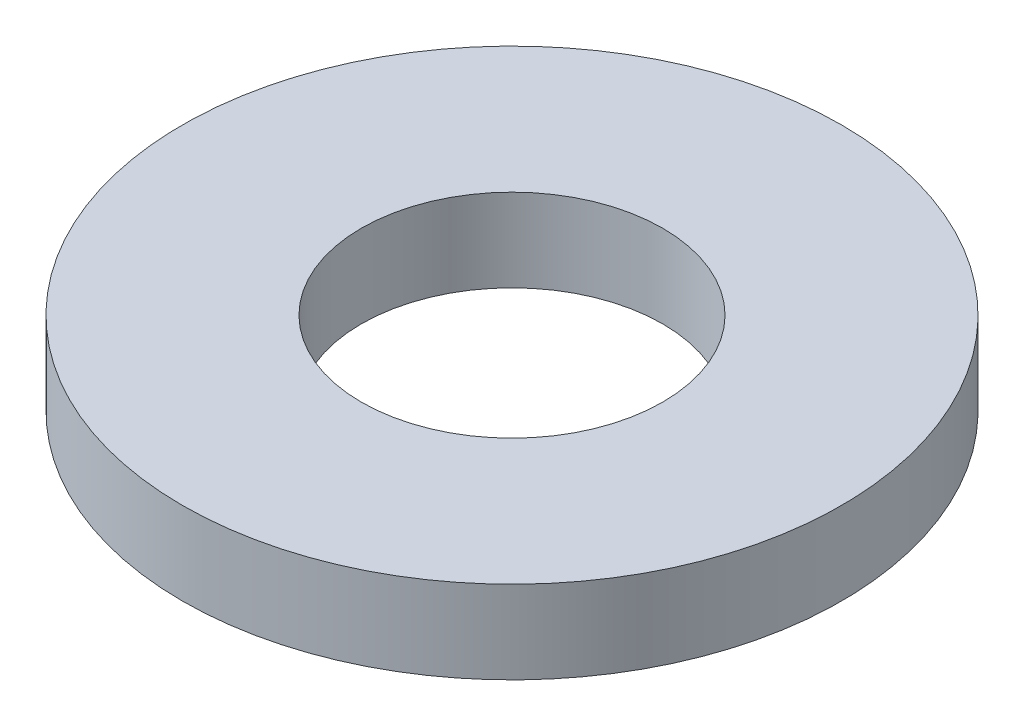
ISO-10303-21;
HEADER;
FILE_DESCRIPTION(('STEP AP214'),'2;1');
FILE_NAME('part.step','',(''),(''),'','','');
FILE_SCHEMA(('AUTOMOTIVE_DESIGN { 1 0 10303 214 1 1 1 1 }'));
ENDSEC;
DATA;
#1=APPLICATION_CONTEXT('core data for automotive mechanical design processes');
#2=APPLICATION_PROTOCOL_DEFINITION('international standard','automotive_design',2000,#1);
#3=PRODUCT_CONTEXT('',#1,'mechanical');
#4=PRODUCT('Part','Part','',(#3));
#5=PRODUCT_RELATED_PRODUCT_CATEGORY('part','',(#4));
#6=PRODUCT_DEFINITION_FORMATION('','',#4);
#7=PRODUCT_DEFINITION_CONTEXT('part definition',#1,'design');
#8=PRODUCT_DEFINITION('design','',#6,#7);
#9=PRODUCT_DEFINITION_SHAPE('','',#8);
#10=(LENGTH_UNIT() NAMED_UNIT(*) SI_UNIT(.MILLI.,.METRE.));
#11=(NAMED_UNIT(*) PLANE_ANGLE_UNIT() SI_UNIT($,.RADIAN.));
#12=(NAMED_UNIT(*) SI_UNIT($,.STERADIAN.) SOLID_ANGLE_UNIT());
#13=UNCERTAINTY_MEASURE_WITH_UNIT(LENGTH_MEASURE(1.E-05),#10,'distance_accuracy_value','');
#14=(GEOMETRIC_REPRESENTATION_CONTEXT(3) GLOBAL_UNCERTAINTY_ASSIGNED_CONTEXT((#13)) GLOBAL_UNIT_ASSIGNED_CONTEXT((#10,
#11,#12)) REPRESENTATION_CONTEXT('',''));
#15=CARTESIAN_POINT('',(0.,0.,0.));
#16=DIRECTION('',(0.,0.,1.));
#17=DIRECTION('',(1.,0.,0.));
#18=AXIS2_PLACEMENT_3D('',#15,#16,#17);
#19=CARTESIAN_POINT('',(0.,22.,0.));
#20=DIRECTION('',(0.,-1.,0.));
#21=DIRECTION('',(0.,0.,-1.));
#22=AXIS2_PLACEMENT_3D('',#19,#20,#21);
#23=CYLINDRICAL_SURFACE('',#22,87.5);
#24=CARTESIAN_POINT('',(0.,22.,0.));
#25=DIRECTION('',(0.,1.,0.));
#26=DIRECTION('',(0.,0.,1.));
#27=AXIS2_PLACEMENT_3D('',#24,#25,#26);
#28=CIRCLE('',#27,87.5);
#29=CARTESIAN_POINT('',(0.,22.,87.5));
#30=VERTEX_POINT('',#29);
#31=EDGE_CURVE('E10',#30,#30,#28,.T.);
#32=ORIENTED_EDGE('',*,*,#31,.F.);
#33=EDGE_LOOP('',(#32));
#34=FACE_BOUND('',#33,.T.);
#35=CARTESIAN_POINT('',(0.,0.,0.));
#36=DIRECTION('',(0.,1.,0.));
#37=DIRECTION('',(0.,0.,1.));
#38=AXIS2_PLACEMENT_3D('',#35,#36,#37);
#39=CIRCLE('',#38,87.5);
#40=CARTESIAN_POINT('',(0.,0.,87.5));
#41=VERTEX_POINT('',#40);
#42=EDGE_CURVE('E37',#41,#41,#39,.T.);
#43=ORIENTED_EDGE('',*,*,#42,.T.);
#44=EDGE_LOOP('',(#43));
#45=FACE_BOUND('',#44,.T.);
#46=ADVANCED_FACE('F40',(#34,#45),#23,.T.);
#47=CARTESIAN_POINT('',(0.,22.,0.));
#48=DIRECTION('',(0.,1.,0.));
#49=DIRECTION('',(0.,0.,1.));
#50=AXIS2_PLACEMENT_3D('',#47,#48,#49);
#51=PLANE('',#50);
#52=CARTESIAN_POINT('',(0.,22.,0.));
#53=DIRECTION('',(0.,1.,0.));
#54=DIRECTION('',(0.,0.,1.));
#55=AXIS2_PLACEMENT_3D('',#52,#53,#54);
#56=CIRCLE('',#55,40.);
#57=CARTESIAN_POINT('',(0.,22.,40.));
#58=VERTEX_POINT('',#57);
#59=EDGE_CURVE('E50',#58,#58,#56,.T.);
#60=ORIENTED_EDGE('',*,*,#59,.F.);
#61=EDGE_LOOP('',(#60));
#62=FACE_BOUND('',#61,.T.);
#63=ORIENTED_EDGE('',*,*,#31,.T.);
#64=EDGE_LOOP('',(#63));
#65=FACE_BOUND('',#64,.T.);
#66=ADVANCED_FACE('F59',(#62,#65),#51,.T.);
#67=CARTESIAN_POINT('',(0.,0.,0.));
#68=DIRECTION('',(0.,1.,0.));
#69=DIRECTION('',(0.,0.,1.));
#70=AXIS2_PLACEMENT_3D('',#67,#68,#69);
#71=PLANE('',#70);
#72=CARTESIAN_POINT('',(0.,0.,0.));
#73=DIRECTION('',(0.,1.,0.));
#74=DIRECTION('',(0.,0.,1.));
#75=AXIS2_PLACEMENT_3D('',#72,#73,#74);
#76=CIRCLE('',#75,40.);
#77=CARTESIAN_POINT('',(0.,0.,40.));
#78=VERTEX_POINT('',#77);
#79=EDGE_CURVE('E47',#78,#78,#76,.T.);
#80=ORIENTED_EDGE('',*,*,#79,.T.);
#81=EDGE_LOOP('',(#80));
#82=FACE_BOUND('',#81,.T.);
#83=ORIENTED_EDGE('',*,*,#42,.F.);
#84=EDGE_LOOP('',(#83));
#85=FACE_BOUND('',#84,.T.);
#86=ADVANCED_FACE('F58',(#82,#85),#71,.F.);
#87=CARTESIAN_POINT('',(0.,22.,0.));
#88=DIRECTION('',(0.,-1.,0.));
#89=DIRECTION('',(0.,0.,-1.));
#90=AXIS2_PLACEMENT_3D('',#87,#88,#89);
#91=CYLINDRICAL_SURFACE('',#90,40.);
#92=ORIENTED_EDGE('',*,*,#59,.T.);
#93=EDGE_LOOP('',(#92));
#94=FACE_BOUND('',#93,.T.);
#95=ORIENTED_EDGE('',*,*,#79,.F.);
#96=EDGE_LOOP('',(#95));
#97=FACE_BOUND('',#96,.T.);
#98=ADVANCED_FACE('F54',(#94,#97),#91,.F.);
#99=CLOSED_SHELL('',(#46,#66,#86,#98));
#100=MANIFOLD_SOLID_BREP('B2',#99);
#101=ADVANCED_BREP_SHAPE_REPRESENTATION('',(#18,#100),#14);
#102=SHAPE_DEFINITION_REPRESENTATION(#9,#101);
ENDSEC;
END-ISO-10303-21;
